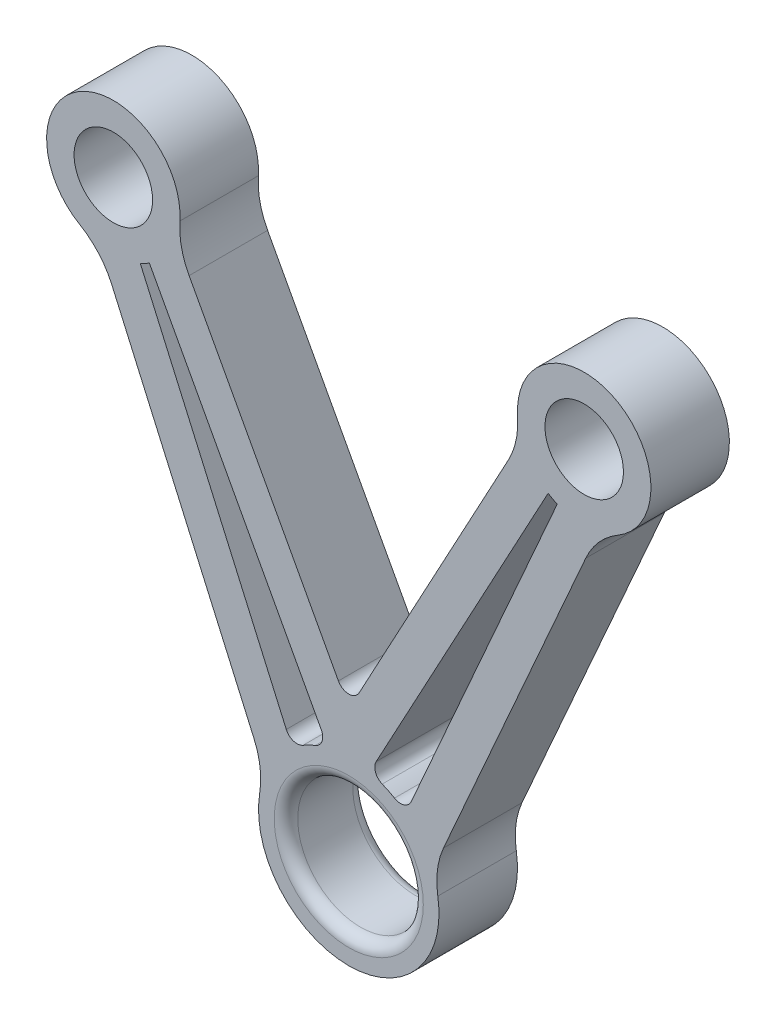
ISO-10303-21;
HEADER;
FILE_DESCRIPTION(('STEP AP214'),'2;1');
FILE_NAME('part.step','',(''),(''),'','','');
FILE_SCHEMA(('AUTOMOTIVE_DESIGN { 1 0 10303 214 1 1 1 1 }'));
ENDSEC;
DATA;
#1=APPLICATION_CONTEXT('core data for automotive mechanical design processes');
#2=APPLICATION_PROTOCOL_DEFINITION('international standard','automotive_design',2000,#1);
#3=PRODUCT_CONTEXT('',#1,'mechanical');
#4=PRODUCT('Part','Part','',(#3));
#5=PRODUCT_RELATED_PRODUCT_CATEGORY('part','',(#4));
#6=PRODUCT_DEFINITION_FORMATION('','',#4);
#7=PRODUCT_DEFINITION_CONTEXT('part definition',#1,'design');
#8=PRODUCT_DEFINITION('design','',#6,#7);
#9=PRODUCT_DEFINITION_SHAPE('','',#8);
#10=(LENGTH_UNIT() NAMED_UNIT(*) SI_UNIT(.MILLI.,.METRE.));
#11=(NAMED_UNIT(*) PLANE_ANGLE_UNIT() SI_UNIT($,.RADIAN.));
#12=(NAMED_UNIT(*) SI_UNIT($,.STERADIAN.) SOLID_ANGLE_UNIT());
#13=UNCERTAINTY_MEASURE_WITH_UNIT(LENGTH_MEASURE(1.E-05),#10,'distance_accuracy_value','');
#14=(GEOMETRIC_REPRESENTATION_CONTEXT(3) GLOBAL_UNCERTAINTY_ASSIGNED_CONTEXT((#13)) GLOBAL_UNIT_ASSIGNED_CONTEXT((#10,
#11,#12)) REPRESENTATION_CONTEXT('',''));
#15=CARTESIAN_POINT('',(0.,0.,0.));
#16=DIRECTION('',(0.,0.,1.));
#17=DIRECTION('',(1.,0.,0.));
#18=AXIS2_PLACEMENT_3D('',#15,#16,#17);
#19=CARTESIAN_POINT('',(-18.260997509463,-9.86478662682293,5.));
#20=DIRECTION('',(0.879827873615152,0.475292449771549,0.));
#21=DIRECTION('',(-0.475292449771549,0.879827873615152,0.));
#22=AXIS2_PLACEMENT_3D('',#19,#20,#21);
#23=PLANE('',#22);
#24=DIRECTION('',(0.475292449771549,-0.879827873615152,0.));
#25=VECTOR('',#24,1.);
#26=CARTESIAN_POINT('',(-18.260997509463,-9.86478662682293,5.));
#27=LINE('',#26,#25);
#28=CARTESIAN_POINT('',(-20.3413015894991,-6.01387438091866,5.));
#29=VERTEX_POINT('',#28);
#30=CARTESIAN_POINT('',(-1.31974181042273,-41.2252447725845,5.));
#31=VERTEX_POINT('',#30);
#32=EDGE_CURVE('E295',#29,#31,#27,.T.);
#33=ORIENTED_EDGE('',*,*,#32,.T.);
#34=DIRECTION('',(0.,0.,-1.));
#35=VECTOR('',#34,1.);
#36=CARTESIAN_POINT('',(-1.31974181042273,-41.2252447725845,5.));
#37=LINE('',#36,#35);
#38=CARTESIAN_POINT('',(-1.31974181042273,-41.2252447725845,-5.));
#39=VERTEX_POINT('',#38);
#40=EDGE_CURVE('E483',#31,#39,#37,.T.);
#41=ORIENTED_EDGE('',*,*,#40,.T.);
#42=DIRECTION('',(0.475292449771549,-0.879827873615152,0.));
#43=VECTOR('',#42,1.);
#44=CARTESIAN_POINT('',(-18.260997509463,-9.86478662682293,-5.));
#45=LINE('',#44,#43);
#46=CARTESIAN_POINT('',(-20.3413015894991,-6.01387438091866,-5.));
#47=VERTEX_POINT('',#46);
#48=EDGE_CURVE('E257',#47,#39,#45,.T.);
#49=ORIENTED_EDGE('',*,*,#48,.F.);
#50=DIRECTION('',(0.,0.,-1.));
#51=VECTOR('',#50,1.);
#52=CARTESIAN_POINT('',(-20.3413015894991,-6.01387438091866,5.));
#53=LINE('',#52,#51);
#54=EDGE_CURVE('E388',#47,#29,#53,.F.);
#55=ORIENTED_EDGE('',*,*,#54,.T.);
#56=EDGE_LOOP('',(#33,#41,#49,#55));
#57=FACE_BOUND('',#56,.T.);
#58=ADVANCED_FACE('F41',(#57),#23,.T.);
#59=CARTESIAN_POINT('',(-30.,0.,5.));
#60=DIRECTION('',(0.,0.,-1.));
#61=DIRECTION('',(-1.,0.,0.));
#62=AXIS2_PLACEMENT_3D('',#59,#60,#61);
#63=CYLINDRICAL_SURFACE('',#62,8.5);
#64=CARTESIAN_POINT('',(-30.,0.,5.));
#65=DIRECTION('',(0.,0.,1.));
#66=DIRECTION('',(1.,0.,0.));
#67=AXIS2_PLACEMENT_3D('',#64,#65,#66);
#68=CIRCLE('',#67,8.5);
#69=CARTESIAN_POINT('',(-21.5197672569435,-0.579355351741999,5.));
#70=VERTEX_POINT('',#69);
#71=CARTESIAN_POINT('',(-34.2943875859806,-7.33540968599409,5.));
#72=VERTEX_POINT('',#71);
#73=EDGE_CURVE('E298',#70,#72,#68,.T.);
#74=ORIENTED_EDGE('',*,*,#73,.F.);
#75=DIRECTION('',(0.,0.,-1.));
#76=VECTOR('',#75,1.);
#77=CARTESIAN_POINT('',(-21.5197672569435,-0.579355351741999,5.));
#78=LINE('',#77,#76);
#79=CARTESIAN_POINT('',(-21.5197672569435,-0.579355351741999,-5.));
#80=VERTEX_POINT('',#79);
#81=EDGE_CURVE('E384',#70,#80,#78,.T.);
#82=ORIENTED_EDGE('',*,*,#81,.T.);
#83=CARTESIAN_POINT('',(-30.,0.,-5.));
#84=DIRECTION('',(0.,0.,1.));
#85=DIRECTION('',(1.,0.,0.));
#86=AXIS2_PLACEMENT_3D('',#83,#84,#85);
#87=CIRCLE('',#86,8.5);
#88=CARTESIAN_POINT('',(-34.2943875859806,-7.33540968599409,-5.));
#89=VERTEX_POINT('',#88);
#90=EDGE_CURVE('E334',#80,#89,#87,.T.);
#91=ORIENTED_EDGE('',*,*,#90,.T.);
#92=DIRECTION('',(0.,0.,-1.));
#93=VECTOR('',#92,1.);
#94=CARTESIAN_POINT('',(-34.2943875859806,-7.33540968599409,5.));
#95=LINE('',#94,#93);
#96=EDGE_CURVE('E381',#89,#72,#95,.F.);
#97=ORIENTED_EDGE('',*,*,#96,.T.);
#98=EDGE_LOOP('',(#74,#82,#91,#97));
#99=FACE_BOUND('',#98,.T.);
#100=ADVANCED_FACE('F532',(#99),#63,.T.);
#101=CARTESIAN_POINT('',(-29.6770389457821,-13.1071615622025,5.));
#102=DIRECTION('',(0.914754376224556,0.404010434491516,0.));
#103=DIRECTION('',(-0.404010434491516,0.914754376224556,0.));
#104=AXIS2_PLACEMENT_3D('',#101,#102,#103);
#105=PLANE('',#104);
#106=DIRECTION('',(0.404010434491516,-0.914754376224556,0.));
#107=VECTOR('',#106,1.);
#108=CARTESIAN_POINT('',(-29.6770389457821,-13.1071615622025,5.));
#109=LINE('',#108,#107);
#110=CARTESIAN_POINT('',(-30.199064513124,-11.9251990893073,5.));
#111=VERTEX_POINT('',#110);
#112=CARTESIAN_POINT('',(-12.0683800088846,-52.9764234594739,5.));
#113=VERTEX_POINT('',#112);
#114=EDGE_CURVE('E303',#111,#113,#109,.T.);
#115=ORIENTED_EDGE('',*,*,#114,.F.);
#116=DIRECTION('',(0.,0.,1.));
#117=VECTOR('',#116,1.);
#118=CARTESIAN_POINT('',(-30.199064513124,-11.9251990893073,-5.));
#119=LINE('',#118,#117);
#120=CARTESIAN_POINT('',(-30.199064513124,-11.9251990893073,-5.));
#121=VERTEX_POINT('',#120);
#122=EDGE_CURVE('E394',#111,#121,#119,.F.);
#123=ORIENTED_EDGE('',*,*,#122,.T.);
#124=DIRECTION('',(0.404010434491516,-0.914754376224556,0.));
#125=VECTOR('',#124,1.);
#126=CARTESIAN_POINT('',(-29.6770389457821,-13.1071615622025,-5.));
#127=LINE('',#126,#125);
#128=CARTESIAN_POINT('',(-12.0683800088846,-52.9764234594739,-5.));
#129=VERTEX_POINT('',#128);
#130=EDGE_CURVE('E338',#121,#129,#127,.T.);
#131=ORIENTED_EDGE('',*,*,#130,.T.);
#132=DIRECTION('',(0.,0.,1.));
#133=VECTOR('',#132,1.);
#134=CARTESIAN_POINT('',(-12.0683800088846,-52.9764234594739,5.));
#135=LINE('',#134,#133);
#136=EDGE_CURVE('E391',#129,#113,#135,.T.);
#137=ORIENTED_EDGE('',*,*,#136,.T.);
#138=EDGE_LOOP('',(#115,#123,#131,#137));
#139=FACE_BOUND('',#138,.T.);
#140=ADVANCED_FACE('F541',(#139),#105,.F.);
#141=CARTESIAN_POINT('',(0.,-60.5,5.));
#142=DIRECTION('',(0.,0.,-1.));
#143=DIRECTION('',(-1.,0.,0.));
#144=AXIS2_PLACEMENT_3D('',#141,#142,#143);
#145=CYLINDRICAL_SURFACE('',#144,11.5);
#146=CARTESIAN_POINT('',(0.,-60.5,5.));
#147=DIRECTION('',(0.,0.,1.));
#148=DIRECTION('',(1.,0.,0.));
#149=AXIS2_PLACEMENT_3D('',#146,#147,#148);
#150=CIRCLE('',#149,11.5);
#151=CARTESIAN_POINT('',(-11.3480522496743,-58.6367474302546,5.));
#152=VERTEX_POINT('',#151);
#153=CARTESIAN_POINT('',(11.3480522496743,-58.6367474302546,5.));
#154=VERTEX_POINT('',#153);
#155=EDGE_CURVE('E307',#152,#154,#150,.T.);
#156=ORIENTED_EDGE('',*,*,#155,.F.);
#157=DIRECTION('',(0.,0.,-1.));
#158=VECTOR('',#157,1.);
#159=CARTESIAN_POINT('',(-11.3480522496743,-58.6367474302546,5.));
#160=LINE('',#159,#158);
#161=CARTESIAN_POINT('',(-11.3480522496743,-58.6367474302546,-5.));
#162=VERTEX_POINT('',#161);
#163=EDGE_CURVE('E401',#152,#162,#160,.T.);
#164=ORIENTED_EDGE('',*,*,#163,.T.);
#165=CARTESIAN_POINT('',(0.,-60.5,-5.));
#166=DIRECTION('',(0.,0.,1.));
#167=DIRECTION('',(1.,0.,0.));
#168=AXIS2_PLACEMENT_3D('',#165,#166,#167);
#169=CIRCLE('',#168,11.5);
#170=CARTESIAN_POINT('',(11.3480522496743,-58.6367474302546,-5.));
#171=VERTEX_POINT('',#170);
#172=EDGE_CURVE('E342',#162,#171,#169,.T.);
#173=ORIENTED_EDGE('',*,*,#172,.T.);
#174=DIRECTION('',(0.,0.,-1.));
#175=VECTOR('',#174,1.);
#176=CARTESIAN_POINT('',(11.3480522496743,-58.6367474302546,5.));
#177=LINE('',#176,#175);
#178=EDGE_CURVE('E398',#171,#154,#177,.F.);
#179=ORIENTED_EDGE('',*,*,#178,.T.);
#180=EDGE_LOOP('',(#156,#164,#173,#179));
#181=FACE_BOUND('',#180,.T.);
#182=ADVANCED_FACE('F550',(#181),#145,.T.);
#183=CARTESIAN_POINT('',(29.6770389457821,-13.1071615622025,5.));
#184=DIRECTION('',(0.914754376224556,-0.404010434491516,0.));
#185=DIRECTION('',(0.404010434491516,0.914754376224556,0.));
#186=AXIS2_PLACEMENT_3D('',#183,#184,#185);
#187=PLANE('',#186);
#188=DIRECTION('',(-0.404010434491516,-0.914754376224556,0.));
#189=VECTOR('',#188,1.);
#190=CARTESIAN_POINT('',(29.6770389457821,-13.1071615622025,-5.));
#191=LINE('',#190,#189);
#192=CARTESIAN_POINT('',(30.199064513124,-11.9251990893073,-5.));
#193=VERTEX_POINT('',#192);
#194=CARTESIAN_POINT('',(12.0683800088846,-52.9764234594739,-5.));
#195=VERTEX_POINT('',#194);
#196=EDGE_CURVE('E346',#193,#195,#191,.T.);
#197=ORIENTED_EDGE('',*,*,#196,.F.);
#198=DIRECTION('',(0.,0.,-1.));
#199=VECTOR('',#198,1.);
#200=CARTESIAN_POINT('',(30.199064513124,-11.9251990893073,5.));
#201=LINE('',#200,#199);
#202=CARTESIAN_POINT('',(30.199064513124,-11.9251990893073,5.));
#203=VERTEX_POINT('',#202);
#204=EDGE_CURVE('E378',#193,#203,#201,.F.);
#205=ORIENTED_EDGE('',*,*,#204,.T.);
#206=DIRECTION('',(-0.404010434491516,-0.914754376224556,0.));
#207=VECTOR('',#206,1.);
#208=CARTESIAN_POINT('',(29.6770389457821,-13.1071615622025,5.));
#209=LINE('',#208,#207);
#210=CARTESIAN_POINT('',(12.0683800088846,-52.9764234594739,5.));
#211=VERTEX_POINT('',#210);
#212=EDGE_CURVE('E311',#203,#211,#209,.T.);
#213=ORIENTED_EDGE('',*,*,#212,.T.);
#214=DIRECTION('',(0.,0.,-1.));
#215=VECTOR('',#214,1.);
#216=CARTESIAN_POINT('',(12.0683800088846,-52.9764234594739,5.));
#217=LINE('',#216,#215);
#218=EDGE_CURVE('E374',#211,#195,#217,.T.);
#219=ORIENTED_EDGE('',*,*,#218,.T.);
#220=EDGE_LOOP('',(#197,#205,#213,#219));
#221=FACE_BOUND('',#220,.T.);
#222=ADVANCED_FACE('F558',(#221),#187,.T.);
#223=CARTESIAN_POINT('',(30.,0.,5.));
#224=DIRECTION('',(0.,0.,-1.));
#225=DIRECTION('',(-1.,0.,0.));
#226=AXIS2_PLACEMENT_3D('',#223,#224,#225);
#227=CYLINDRICAL_SURFACE('',#226,8.5);
#228=CARTESIAN_POINT('',(30.,0.,-5.));
#229=DIRECTION('',(0.,0.,1.));
#230=DIRECTION('',(1.,0.,0.));
#231=AXIS2_PLACEMENT_3D('',#228,#229,#230);
#232=CIRCLE('',#231,8.5);
#233=CARTESIAN_POINT('',(34.2943875859806,-7.33540968599409,-5.));
#234=VERTEX_POINT('',#233);
#235=CARTESIAN_POINT('',(21.5197672569435,-0.579355351741998,-5.));
#236=VERTEX_POINT('',#235);
#237=EDGE_CURVE('E350',#234,#236,#232,.T.);
#238=ORIENTED_EDGE('',*,*,#237,.T.);
#239=DIRECTION('',(0.,0.,-1.));
#240=VECTOR('',#239,1.);
#241=CARTESIAN_POINT('',(21.5197672569435,-0.579355351741998,5.));
#242=LINE('',#241,#240);
#243=CARTESIAN_POINT('',(21.5197672569435,-0.579355351741998,5.));
#244=VERTEX_POINT('',#243);
#245=EDGE_CURVE('E371',#236,#244,#242,.F.);
#246=ORIENTED_EDGE('',*,*,#245,.T.);
#247=CARTESIAN_POINT('',(30.,0.,5.));
#248=DIRECTION('',(0.,0.,1.));
#249=DIRECTION('',(1.,0.,0.));
#250=AXIS2_PLACEMENT_3D('',#247,#248,#249);
#251=CIRCLE('',#250,8.5);
#252=CARTESIAN_POINT('',(34.2943875859806,-7.33540968599409,5.));
#253=VERTEX_POINT('',#252);
#254=EDGE_CURVE('E315',#253,#244,#251,.T.);
#255=ORIENTED_EDGE('',*,*,#254,.F.);
#256=DIRECTION('',(0.,0.,-1.));
#257=VECTOR('',#256,1.);
#258=CARTESIAN_POINT('',(34.2943875859806,-7.33540968599409,5.));
#259=LINE('',#258,#257);
#260=EDGE_CURVE('E367',#253,#234,#259,.T.);
#261=ORIENTED_EDGE('',*,*,#260,.T.);
#262=EDGE_LOOP('',(#238,#246,#255,#261));
#263=FACE_BOUND('',#262,.T.);
#264=ADVANCED_FACE('F568',(#263),#227,.T.);
#265=CARTESIAN_POINT('',(-30.,0.,5.));
#266=DIRECTION('',(0.,0.,-1.));
#267=DIRECTION('',(-1.,0.,0.));
#268=AXIS2_PLACEMENT_3D('',#265,#266,#267);
#269=CYLINDRICAL_SURFACE('',#268,5.);
#270=CARTESIAN_POINT('',(-30.,0.,5.));
#271=DIRECTION('',(0.,0.,1.));
#272=DIRECTION('',(1.,0.,0.));
#273=AXIS2_PLACEMENT_3D('',#270,#271,#272);
#274=CIRCLE('',#273,5.);
#275=CARTESIAN_POINT('',(-25.,0.,5.));
#276=VERTEX_POINT('',#275);
#277=EDGE_CURVE('E326',#276,#276,#274,.T.);
#278=ORIENTED_EDGE('',*,*,#277,.T.);
#279=EDGE_LOOP('',(#278));
#280=FACE_BOUND('',#279,.T.);
#281=CARTESIAN_POINT('',(-30.,0.,-5.));
#282=DIRECTION('',(0.,0.,1.));
#283=DIRECTION('',(1.,0.,0.));
#284=AXIS2_PLACEMENT_3D('',#281,#282,#283);
#285=CIRCLE('',#284,5.);
#286=CARTESIAN_POINT('',(-25.,0.,-5.));
#287=VERTEX_POINT('',#286);
#288=EDGE_CURVE('E299',#287,#287,#285,.T.);
#289=ORIENTED_EDGE('',*,*,#288,.F.);
#290=EDGE_LOOP('',(#289));
#291=FACE_BOUND('',#290,.T.);
#292=ADVANCED_FACE('F597',(#280,#291),#269,.F.);
#293=CARTESIAN_POINT('',(30.,0.,5.));
#294=DIRECTION('',(0.,0.,-1.));
#295=DIRECTION('',(-1.,0.,0.));
#296=AXIS2_PLACEMENT_3D('',#293,#294,#295);
#297=CYLINDRICAL_SURFACE('',#296,5.);
#298=CARTESIAN_POINT('',(30.,0.,5.));
#299=DIRECTION('',(0.,0.,1.));
#300=DIRECTION('',(1.,0.,0.));
#301=AXIS2_PLACEMENT_3D('',#298,#299,#300);
#302=CIRCLE('',#301,5.);
#303=CARTESIAN_POINT('',(35.,0.,5.));
#304=VERTEX_POINT('',#303);
#305=EDGE_CURVE('E322',#304,#304,#302,.T.);
#306=ORIENTED_EDGE('',*,*,#305,.T.);
#307=EDGE_LOOP('',(#306));
#308=FACE_BOUND('',#307,.T.);
#309=CARTESIAN_POINT('',(30.,0.,-5.));
#310=DIRECTION('',(0.,0.,1.));
#311=DIRECTION('',(1.,0.,0.));
#312=AXIS2_PLACEMENT_3D('',#309,#310,#311);
#313=CIRCLE('',#312,5.);
#314=CARTESIAN_POINT('',(35.,0.,-5.));
#315=VERTEX_POINT('',#314);
#316=EDGE_CURVE('E357',#315,#315,#313,.T.);
#317=ORIENTED_EDGE('',*,*,#316,.F.);
#318=EDGE_LOOP('',(#317));
#319=FACE_BOUND('',#318,.T.);
#320=ADVANCED_FACE('F601',(#308,#319),#297,.F.);
#321=CARTESIAN_POINT('',(18.260997509463,-9.86478662682293,5.));
#322=DIRECTION('',(0.879827873615152,-0.475292449771549,0.));
#323=DIRECTION('',(0.475292449771549,0.879827873615152,0.));
#324=AXIS2_PLACEMENT_3D('',#321,#322,#323);
#325=PLANE('',#324);
#326=DIRECTION('',(-0.475292449771549,-0.879827873615152,0.));
#327=VECTOR('',#326,1.);
#328=CARTESIAN_POINT('',(18.260997509463,-9.86478662682293,-5.));
#329=LINE('',#328,#327);
#330=CARTESIAN_POINT('',(20.3413015894991,-6.01387438091866,-5.));
#331=VERTEX_POINT('',#330);
#332=CARTESIAN_POINT('',(1.31974181042272,-41.2252447725845,-5.));
#333=VERTEX_POINT('',#332);
#334=EDGE_CURVE('E354',#331,#333,#329,.T.);
#335=ORIENTED_EDGE('',*,*,#334,.T.);
#336=DIRECTION('',(0.,0.,-1.));
#337=VECTOR('',#336,1.);
#338=CARTESIAN_POINT('',(1.31974181042273,-41.2252447725845,5.));
#339=LINE('',#338,#337);
#340=CARTESIAN_POINT('',(1.31974181042272,-41.2252447725845,5.));
#341=VERTEX_POINT('',#340);
#342=EDGE_CURVE('E57',#333,#341,#339,.F.);
#343=ORIENTED_EDGE('',*,*,#342,.T.);
#344=DIRECTION('',(-0.475292449771549,-0.879827873615152,0.));
#345=VECTOR('',#344,1.);
#346=CARTESIAN_POINT('',(18.260997509463,-9.86478662682293,5.));
#347=LINE('',#346,#345);
#348=CARTESIAN_POINT('',(20.3413015894991,-6.01387438091866,5.));
#349=VERTEX_POINT('',#348);
#350=EDGE_CURVE('E319',#349,#341,#347,.T.);
#351=ORIENTED_EDGE('',*,*,#350,.F.);
#352=DIRECTION('',(0.,0.,1.));
#353=VECTOR('',#352,1.);
#354=CARTESIAN_POINT('',(20.3413015894991,-6.01387438091866,-5.));
#355=LINE('',#354,#353);
#356=EDGE_CURVE('E330',#349,#331,#355,.F.);
#357=ORIENTED_EDGE('',*,*,#356,.T.);
#358=EDGE_LOOP('',(#335,#343,#351,#357));
#359=FACE_BOUND('',#358,.T.);
#360=ADVANCED_FACE('F521',(#359),#325,.F.);
#361=CARTESIAN_POINT('',(0.,-60.5,5.));
#362=DIRECTION('',(0.,0.,-1.));
#363=DIRECTION('',(-1.,0.,0.));
#364=AXIS2_PLACEMENT_3D('',#361,#362,#363);
#365=CYLINDRICAL_SURFACE('',#364,8.);
#366=CARTESIAN_POINT('',(0.,-60.5,-3.5));
#367=DIRECTION('',(0.,0.,1.));
#368=DIRECTION('',(1.,0.,0.));
#369=AXIS2_PLACEMENT_3D('',#366,#367,#368);
#370=CIRCLE('',#369,8.);
#371=CARTESIAN_POINT('',(8.,-60.5,-3.5));
#372=VERTEX_POINT('',#371);
#373=EDGE_CURVE('E449',#372,#372,#370,.F.);
#374=ORIENTED_EDGE('',*,*,#373,.T.);
#375=EDGE_LOOP('',(#374));
#376=FACE_BOUND('',#375,.T.);
#377=CARTESIAN_POINT('',(0.,-60.5,3.5));
#378=DIRECTION('',(0.,0.,1.));
#379=DIRECTION('',(1.,0.,0.));
#380=AXIS2_PLACEMENT_3D('',#377,#378,#379);
#381=CIRCLE('',#380,8.);
#382=CARTESIAN_POINT('',(8.,-60.5,3.5));
#383=VERTEX_POINT('',#382);
#384=EDGE_CURVE('E445',#383,#383,#381,.T.);
#385=ORIENTED_EDGE('',*,*,#384,.T.);
#386=EDGE_LOOP('',(#385));
#387=FACE_BOUND('',#386,.T.);
#388=ADVANCED_FACE('F600',(#376,#387),#365,.F.);
#389=CARTESIAN_POINT('',(0.,0.,5.));
#390=DIRECTION('',(0.,0.,1.));
#391=DIRECTION('',(1.,0.,0.));
#392=AXIS2_PLACEMENT_3D('',#389,#390,#391);
#393=PLANE('',#392);
#394=CARTESIAN_POINT('',(0.,-60.5,5.));
#395=DIRECTION('',(0.,0.,1.));
#396=DIRECTION('',(1.,0.,0.));
#397=AXIS2_PLACEMENT_3D('',#394,#395,#396);
#398=CIRCLE('',#397,9.5);
#399=CARTESIAN_POINT('',(9.5,-60.5,5.));
#400=VERTEX_POINT('',#399);
#401=EDGE_CURVE('E453',#400,#400,#398,.F.);
#402=ORIENTED_EDGE('',*,*,#401,.T.);
#403=EDGE_LOOP('',(#402));
#404=FACE_BOUND('',#403,.T.);
#405=CARTESIAN_POINT('',(0.,-60.5,5.));
#406=DIRECTION('',(0.,0.,-1.));
#407=DIRECTION('',(1.,0.,0.));
#408=AXIS2_PLACEMENT_3D('',#405,#406,#407);
#409=CIRCLE('',#408,11.5);
#410=CARTESIAN_POINT('',(4.26189216184041,-49.8188823056366,5.));
#411=VERTEX_POINT('',#410);
#412=CARTESIAN_POINT('',(5.82889674170213,-50.5866775108153,5.));
#413=VERTEX_POINT('',#412);
#414=EDGE_CURVE('E228',#411,#413,#409,.T.);
#415=ORIENTED_EDGE('',*,*,#414,.F.);
#416=CARTESIAN_POINT('',(4.81779113947177,-48.4256930411544,5.));
#417=DIRECTION('',(0.,0.,1.));
#418=DIRECTION('',(1.,0.,0.));
#419=AXIS2_PLACEMENT_3D('',#416,#417,#418);
#420=CIRCLE('',#419,1.5);
#421=CARTESIAN_POINT('',(3.49804932904904,-47.7127543664971,5.));
#422=VERTEX_POINT('',#421);
#423=EDGE_CURVE('E495',#411,#422,#420,.F.);
#424=ORIENTED_EDGE('',*,*,#423,.T.);
#425=DIRECTION('',(-0.475292449771549,-0.879827873615152,0.));
#426=VECTOR('',#425,1.);
#427=CARTESIAN_POINT('',(25.4086936589943,-7.15331434252971,5.));
#428=LINE('',#427,#426);
#429=CARTESIAN_POINT('',(25.4086936589943,-7.15331434252971,5.));
#430=VERTEX_POINT('',#429);
#431=EDGE_CURVE('E240',#430,#422,#428,.T.);
#432=ORIENTED_EDGE('',*,*,#431,.F.);
#433=CARTESIAN_POINT('',(30.,0.,5.));
#434=DIRECTION('',(0.,0.,-1.));
#435=DIRECTION('',(1.,0.,0.));
#436=AXIS2_PLACEMENT_3D('',#433,#434,#435);
#437=CIRCLE('',#436,8.5);
#438=CARTESIAN_POINT('',(26.5659113068221,-7.77541219790873,5.));
#439=VERTEX_POINT('',#438);
#440=EDGE_CURVE('E227',#439,#430,#437,.T.);
#441=ORIENTED_EDGE('',*,*,#440,.F.);
#442=DIRECTION('',(0.404010434491515,0.914754376224556,0.));
#443=VECTOR('',#442,1.);
#444=CARTESIAN_POINT('',(26.5659113068221,-7.77541219790873,5.));
#445=LINE('',#444,#443);
#446=CARTESIAN_POINT('',(7.96131918539142,-49.8996510987459,5.));
#447=VERTEX_POINT('',#446);
#448=EDGE_CURVE('E216',#447,#439,#445,.T.);
#449=ORIENTED_EDGE('',*,*,#448,.F.);
#450=CARTESIAN_POINT('',(6.58918762105459,-49.2936354470087,5.));
#451=DIRECTION('',(0.,0.,1.));
#452=DIRECTION('',(1.,0.,0.));
#453=AXIS2_PLACEMENT_3D('',#450,#451,#452);
#454=CIRCLE('',#453,1.5);
#455=EDGE_CURVE('E489',#447,#413,#454,.F.);
#456=ORIENTED_EDGE('',*,*,#455,.T.);
#457=EDGE_LOOP('',(#415,#424,#432,#441,#449,#456));
#458=FACE_BOUND('',#457,.T.);
#459=CARTESIAN_POINT('',(-30.,0.,5.));
#460=DIRECTION('',(0.,0.,-1.));
#461=DIRECTION('',(1.,0.,0.));
#462=AXIS2_PLACEMENT_3D('',#459,#460,#461);
#463=CIRCLE('',#462,8.5);
#464=CARTESIAN_POINT('',(-25.4086936589943,-7.15331434252971,5.));
#465=VERTEX_POINT('',#464);
#466=CARTESIAN_POINT('',(-26.5659113068221,-7.77541219790873,5.));
#467=VERTEX_POINT('',#466);
#468=EDGE_CURVE('E272',#465,#467,#463,.T.);
#469=ORIENTED_EDGE('',*,*,#468,.F.);
#470=DIRECTION('',(-0.475292449771549,0.879827873615152,0.));
#471=VECTOR('',#470,1.);
#472=CARTESIAN_POINT('',(-25.4086936589943,-7.15331434252971,5.));
#473=LINE('',#472,#471);
#474=CARTESIAN_POINT('',(-3.49804932904904,-47.7127543664971,5.));
#475=VERTEX_POINT('',#474);
#476=EDGE_CURVE('E283',#475,#465,#473,.T.);
#477=ORIENTED_EDGE('',*,*,#476,.F.);
#478=CARTESIAN_POINT('',(-4.81779113947178,-48.4256930411544,5.));
#479=DIRECTION('',(0.,0.,1.));
#480=DIRECTION('',(1.,0.,0.));
#481=AXIS2_PLACEMENT_3D('',#478,#479,#480);
#482=CIRCLE('',#481,1.5);
#483=CARTESIAN_POINT('',(-4.26189216184042,-49.8188823056366,5.));
#484=VERTEX_POINT('',#483);
#485=EDGE_CURVE('E501',#475,#484,#482,.F.);
#486=ORIENTED_EDGE('',*,*,#485,.T.);
#487=CARTESIAN_POINT('',(0.,-60.5,5.));
#488=DIRECTION('',(0.,0.,-1.));
#489=DIRECTION('',(1.,0.,0.));
#490=AXIS2_PLACEMENT_3D('',#487,#488,#489);
#491=CIRCLE('',#490,11.5);
#492=CARTESIAN_POINT('',(-5.82889674170214,-50.5866775108153,5.));
#493=VERTEX_POINT('',#492);
#494=EDGE_CURVE('E279',#493,#484,#491,.T.);
#495=ORIENTED_EDGE('',*,*,#494,.F.);
#496=CARTESIAN_POINT('',(-6.58918762105459,-49.2936354470087,5.));
#497=DIRECTION('',(0.,0.,1.));
#498=DIRECTION('',(1.,0.,0.));
#499=AXIS2_PLACEMENT_3D('',#496,#497,#498);
#500=CIRCLE('',#499,1.5);
#501=CARTESIAN_POINT('',(-7.96131918539142,-49.8996510987459,5.));
#502=VERTEX_POINT('',#501);
#503=EDGE_CURVE('E507',#493,#502,#500,.F.);
#504=ORIENTED_EDGE('',*,*,#503,.T.);
#505=DIRECTION('',(0.404010434491515,-0.914754376224556,0.));
#506=VECTOR('',#505,1.);
#507=CARTESIAN_POINT('',(-26.5659113068221,-7.77541219790873,5.));
#508=LINE('',#507,#506);
#509=EDGE_CURVE('E275',#467,#502,#508,.T.);
#510=ORIENTED_EDGE('',*,*,#509,.F.);
#511=EDGE_LOOP('',(#469,#477,#486,#495,#504,#510));
#512=FACE_BOUND('',#511,.T.);
#513=ORIENTED_EDGE('',*,*,#32,.F.);
#514=CARTESIAN_POINT('',(-11.5430228533476,-1.26094988320317,5.));
#515=DIRECTION('',(0.,0.,1.));
#516=DIRECTION('',(1.,0.,0.));
#517=AXIS2_PLACEMENT_3D('',#514,#515,#516);
#518=CIRCLE('',#517,10.);
#519=EDGE_CURVE('E420',#29,#70,#518,.F.);
#520=ORIENTED_EDGE('',*,*,#519,.T.);
#521=ORIENTED_EDGE('',*,*,#73,.T.);
#522=CARTESIAN_POINT('',(-39.3466082753695,-15.9653034342224,5.));
#523=DIRECTION('',(0.,0.,1.));
#524=DIRECTION('',(1.,0.,0.));
#525=AXIS2_PLACEMENT_3D('',#522,#523,#524);
#526=CIRCLE('',#525,10.);
#527=EDGE_CURVE('E426',#72,#111,#526,.F.);
#528=ORIENTED_EDGE('',*,*,#527,.T.);
#529=ORIENTED_EDGE('',*,*,#114,.T.);
#530=CARTESIAN_POINT('',(-21.2159237711301,-57.016527804389,5.));
#531=DIRECTION('',(0.,0.,1.));
#532=DIRECTION('',(1.,0.,0.));
#533=AXIS2_PLACEMENT_3D('',#530,#531,#532);
#534=CIRCLE('',#533,10.);
#535=EDGE_CURVE('E432',#113,#152,#534,.F.);
#536=ORIENTED_EDGE('',*,*,#535,.T.);
#537=ORIENTED_EDGE('',*,*,#155,.T.);
#538=CARTESIAN_POINT('',(21.2159237711301,-57.016527804389,5.));
#539=DIRECTION('',(0.,0.,1.));
#540=DIRECTION('',(1.,0.,0.));
#541=AXIS2_PLACEMENT_3D('',#538,#539,#540);
#542=CIRCLE('',#541,10.);
#543=EDGE_CURVE('E438',#154,#211,#542,.F.);
#544=ORIENTED_EDGE('',*,*,#543,.T.);
#545=ORIENTED_EDGE('',*,*,#212,.F.);
#546=CARTESIAN_POINT('',(39.3466082753695,-15.9653034342224,5.));
#547=DIRECTION('',(0.,0.,1.));
#548=DIRECTION('',(1.,0.,0.));
#549=AXIS2_PLACEMENT_3D('',#546,#547,#548);
#550=CIRCLE('',#549,10.);
#551=EDGE_CURVE('E414',#203,#253,#550,.F.);
#552=ORIENTED_EDGE('',*,*,#551,.T.);
#553=ORIENTED_EDGE('',*,*,#254,.T.);
#554=CARTESIAN_POINT('',(11.5430228533476,-1.26094988320317,5.));
#555=DIRECTION('',(0.,0.,1.));
#556=DIRECTION('',(1.,0.,0.));
#557=AXIS2_PLACEMENT_3D('',#554,#555,#556);
#558=CIRCLE('',#557,10.);
#559=EDGE_CURVE('E408',#244,#349,#558,.F.);
#560=ORIENTED_EDGE('',*,*,#559,.T.);
#561=ORIENTED_EDGE('',*,*,#350,.T.);
#562=CARTESIAN_POINT('',(0.,-40.5123060979272,5.));
#563=DIRECTION('',(0.,0.,1.));
#564=DIRECTION('',(1.,0.,0.));
#565=AXIS2_PLACEMENT_3D('',#562,#563,#564);
#566=CIRCLE('',#565,1.5);
#567=EDGE_CURVE('E11',#341,#31,#566,.F.);
#568=ORIENTED_EDGE('',*,*,#567,.T.);
#569=EDGE_LOOP('',(#513,#520,#521,#528,#529,#536,#537,#544,#545,#552,#553,#560,#561,#568));
#570=FACE_BOUND('',#569,.T.);
#571=ORIENTED_EDGE('',*,*,#305,.F.);
#572=EDGE_LOOP('',(#571));
#573=FACE_BOUND('',#572,.T.);
#574=ORIENTED_EDGE('',*,*,#277,.F.);
#575=EDGE_LOOP('',(#574));
#576=FACE_BOUND('',#575,.T.);
#577=ADVANCED_FACE('F243',(#404,#458,#512,#570,#573,#576),#393,.T.);
#578=CARTESIAN_POINT('',(0.,0.,-5.));
#579=DIRECTION('',(0.,0.,1.));
#580=DIRECTION('',(1.,0.,0.));
#581=AXIS2_PLACEMENT_3D('',#578,#579,#580);
#582=PLANE('',#581);
#583=CARTESIAN_POINT('',(0.,-60.5,-5.));
#584=DIRECTION('',(0.,0.,1.));
#585=DIRECTION('',(1.,0.,0.));
#586=AXIS2_PLACEMENT_3D('',#583,#584,#585);
#587=CIRCLE('',#586,9.5);
#588=CARTESIAN_POINT('',(9.5,-60.5,-5.));
#589=VERTEX_POINT('',#588);
#590=EDGE_CURVE('E441',#589,#589,#587,.T.);
#591=ORIENTED_EDGE('',*,*,#590,.T.);
#592=EDGE_LOOP('',(#591));
#593=FACE_BOUND('',#592,.T.);
#594=DIRECTION('',(0.475292449771549,0.879827873615152,0.));
#595=VECTOR('',#594,1.);
#596=CARTESIAN_POINT('',(25.4086936589943,-7.15331434252971,-5.));
#597=LINE('',#596,#595);
#598=CARTESIAN_POINT('',(3.49804932904904,-47.7127543664971,-5.));
#599=VERTEX_POINT('',#598);
#600=CARTESIAN_POINT('',(25.4086936589943,-7.15331434252971,-5.));
#601=VERTEX_POINT('',#600);
#602=EDGE_CURVE('E655',#599,#601,#597,.T.);
#603=ORIENTED_EDGE('',*,*,#602,.F.);
#604=CARTESIAN_POINT('',(4.81779113947177,-48.4256930411544,-5.));
#605=DIRECTION('',(0.,0.,1.));
#606=DIRECTION('',(1.,0.,0.));
#607=AXIS2_PLACEMENT_3D('',#604,#605,#606);
#608=CIRCLE('',#607,1.5);
#609=CARTESIAN_POINT('',(4.26189216184041,-49.8188823056366,-5.));
#610=VERTEX_POINT('',#609);
#611=EDGE_CURVE('E498',#599,#610,#608,.T.);
#612=ORIENTED_EDGE('',*,*,#611,.T.);
#613=CARTESIAN_POINT('',(0.,-60.5,-5.));
#614=DIRECTION('',(0.,0.,1.));
#615=DIRECTION('',(1.,0.,0.));
#616=AXIS2_PLACEMENT_3D('',#613,#614,#615);
#617=CIRCLE('',#616,11.5);
#618=CARTESIAN_POINT('',(5.82889674170213,-50.5866775108153,-5.));
#619=VERTEX_POINT('',#618);
#620=EDGE_CURVE('E258',#619,#610,#617,.T.);
#621=ORIENTED_EDGE('',*,*,#620,.F.);
#622=CARTESIAN_POINT('',(6.58918762105459,-49.2936354470087,-5.));
#623=DIRECTION('',(0.,0.,1.));
#624=DIRECTION('',(1.,0.,0.));
#625=AXIS2_PLACEMENT_3D('',#622,#623,#624);
#626=CIRCLE('',#625,1.5);
#627=CARTESIAN_POINT('',(7.96131918539142,-49.8996510987459,-5.));
#628=VERTEX_POINT('',#627);
#629=EDGE_CURVE('E492',#619,#628,#626,.T.);
#630=ORIENTED_EDGE('',*,*,#629,.T.);
#631=DIRECTION('',(-0.404010434491515,-0.914754376224556,0.));
#632=VECTOR('',#631,1.);
#633=CARTESIAN_POINT('',(26.5659113068221,-7.77541219790873,-5.));
#634=LINE('',#633,#632);
#635=CARTESIAN_POINT('',(26.5659113068221,-7.77541219790873,-5.));
#636=VERTEX_POINT('',#635);
#637=EDGE_CURVE('E254',#636,#628,#634,.T.);
#638=ORIENTED_EDGE('',*,*,#637,.F.);
#639=CARTESIAN_POINT('',(30.,0.,-5.));
#640=DIRECTION('',(0.,0.,1.));
#641=DIRECTION('',(1.,0.,0.));
#642=AXIS2_PLACEMENT_3D('',#639,#640,#641);
#643=CIRCLE('',#642,8.5);
#644=EDGE_CURVE('E236',#601,#636,#643,.T.);
#645=ORIENTED_EDGE('',*,*,#644,.F.);
#646=EDGE_LOOP('',(#603,#612,#621,#630,#638,#645));
#647=FACE_BOUND('',#646,.T.);
#648=DIRECTION('',(0.475292449771549,-0.879827873615152,0.));
#649=VECTOR('',#648,1.);
#650=CARTESIAN_POINT('',(-25.4086936589943,-7.15331434252971,-5.));
#651=LINE('',#650,#649);
#652=CARTESIAN_POINT('',(-25.4086936589943,-7.15331434252971,-5.));
#653=VERTEX_POINT('',#652);
#654=CARTESIAN_POINT('',(-3.49804932904905,-47.7127543664971,-5.));
#655=VERTEX_POINT('',#654);
#656=EDGE_CURVE('E263',#653,#655,#651,.T.);
#657=ORIENTED_EDGE('',*,*,#656,.F.);
#658=CARTESIAN_POINT('',(-30.,0.,-5.));
#659=DIRECTION('',(0.,0.,1.));
#660=DIRECTION('',(1.,0.,0.));
#661=AXIS2_PLACEMENT_3D('',#658,#659,#660);
#662=CIRCLE('',#661,8.5);
#663=CARTESIAN_POINT('',(-26.5659113068221,-7.77541219790873,-5.));
#664=VERTEX_POINT('',#663);
#665=EDGE_CURVE('E268',#664,#653,#662,.T.);
#666=ORIENTED_EDGE('',*,*,#665,.F.);
#667=DIRECTION('',(-0.404010434491515,0.914754376224556,0.));
#668=VECTOR('',#667,1.);
#669=CARTESIAN_POINT('',(-26.5659113068221,-7.77541219790873,-5.));
#670=LINE('',#669,#668);
#671=CARTESIAN_POINT('',(-7.96131918539142,-49.8996510987459,-5.));
#672=VERTEX_POINT('',#671);
#673=EDGE_CURVE('E271',#672,#664,#670,.T.);
#674=ORIENTED_EDGE('',*,*,#673,.F.);
#675=CARTESIAN_POINT('',(-6.58918762105459,-49.2936354470087,-5.));
#676=DIRECTION('',(0.,0.,1.));
#677=DIRECTION('',(1.,0.,0.));
#678=AXIS2_PLACEMENT_3D('',#675,#676,#677);
#679=CIRCLE('',#678,1.5);
#680=CARTESIAN_POINT('',(-5.82889674170214,-50.5866775108153,-5.));
#681=VERTEX_POINT('',#680);
#682=EDGE_CURVE('E510',#672,#681,#679,.T.);
#683=ORIENTED_EDGE('',*,*,#682,.T.);
#684=CARTESIAN_POINT('',(0.,-60.5,-5.));
#685=DIRECTION('',(0.,0.,1.));
#686=DIRECTION('',(1.,0.,0.));
#687=AXIS2_PLACEMENT_3D('',#684,#685,#686);
#688=CIRCLE('',#687,11.5);
#689=CARTESIAN_POINT('',(-4.26189216184042,-49.8188823056366,-5.));
#690=VERTEX_POINT('',#689);
#691=EDGE_CURVE('E259',#690,#681,#688,.T.);
#692=ORIENTED_EDGE('',*,*,#691,.F.);
#693=CARTESIAN_POINT('',(-4.81779113947178,-48.4256930411544,-5.));
#694=DIRECTION('',(0.,0.,1.));
#695=DIRECTION('',(1.,0.,0.));
#696=AXIS2_PLACEMENT_3D('',#693,#694,#695);
#697=CIRCLE('',#696,1.5);
#698=EDGE_CURVE('E504',#690,#655,#697,.T.);
#699=ORIENTED_EDGE('',*,*,#698,.T.);
#700=EDGE_LOOP('',(#657,#666,#674,#683,#692,#699));
#701=FACE_BOUND('',#700,.T.);
#702=ORIENTED_EDGE('',*,*,#90,.F.);
#703=CARTESIAN_POINT('',(-11.5430228533476,-1.26094988320317,-5.));
#704=DIRECTION('',(0.,0.,1.));
#705=DIRECTION('',(1.,0.,0.));
#706=AXIS2_PLACEMENT_3D('',#703,#704,#705);
#707=CIRCLE('',#706,10.);
#708=EDGE_CURVE('E417',#80,#47,#707,.T.);
#709=ORIENTED_EDGE('',*,*,#708,.T.);
#710=ORIENTED_EDGE('',*,*,#48,.T.);
#711=CARTESIAN_POINT('',(0.,-40.5123060979272,-5.));
#712=DIRECTION('',(0.,0.,1.));
#713=DIRECTION('',(1.,0.,0.));
#714=AXIS2_PLACEMENT_3D('',#711,#712,#713);
#715=CIRCLE('',#714,1.5);
#716=EDGE_CURVE('E50',#39,#333,#715,.T.);
#717=ORIENTED_EDGE('',*,*,#716,.T.);
#718=ORIENTED_EDGE('',*,*,#334,.F.);
#719=CARTESIAN_POINT('',(11.5430228533476,-1.26094988320317,-5.));
#720=DIRECTION('',(0.,0.,1.));
#721=DIRECTION('',(1.,0.,0.));
#722=AXIS2_PLACEMENT_3D('',#719,#720,#721);
#723=CIRCLE('',#722,10.);
#724=EDGE_CURVE('E405',#331,#236,#723,.T.);
#725=ORIENTED_EDGE('',*,*,#724,.T.);
#726=ORIENTED_EDGE('',*,*,#237,.F.);
#727=CARTESIAN_POINT('',(39.3466082753695,-15.9653034342224,-5.));
#728=DIRECTION('',(0.,0.,1.));
#729=DIRECTION('',(1.,0.,0.));
#730=AXIS2_PLACEMENT_3D('',#727,#728,#729);
#731=CIRCLE('',#730,10.);
#732=EDGE_CURVE('E411',#234,#193,#731,.T.);
#733=ORIENTED_EDGE('',*,*,#732,.T.);
#734=ORIENTED_EDGE('',*,*,#196,.T.);
#735=CARTESIAN_POINT('',(21.2159237711301,-57.016527804389,-5.));
#736=DIRECTION('',(0.,0.,1.));
#737=DIRECTION('',(1.,0.,0.));
#738=AXIS2_PLACEMENT_3D('',#735,#736,#737);
#739=CIRCLE('',#738,10.);
#740=EDGE_CURVE('E435',#195,#171,#739,.T.);
#741=ORIENTED_EDGE('',*,*,#740,.T.);
#742=ORIENTED_EDGE('',*,*,#172,.F.);
#743=CARTESIAN_POINT('',(-21.2159237711301,-57.016527804389,-5.));
#744=DIRECTION('',(0.,0.,1.));
#745=DIRECTION('',(1.,0.,0.));
#746=AXIS2_PLACEMENT_3D('',#743,#744,#745);
#747=CIRCLE('',#746,10.);
#748=EDGE_CURVE('E429',#162,#129,#747,.T.);
#749=ORIENTED_EDGE('',*,*,#748,.T.);
#750=ORIENTED_EDGE('',*,*,#130,.F.);
#751=CARTESIAN_POINT('',(-39.3466082753695,-15.9653034342224,-5.));
#752=DIRECTION('',(0.,0.,1.));
#753=DIRECTION('',(1.,0.,0.));
#754=AXIS2_PLACEMENT_3D('',#751,#752,#753);
#755=CIRCLE('',#754,10.);
#756=EDGE_CURVE('E423',#121,#89,#755,.T.);
#757=ORIENTED_EDGE('',*,*,#756,.T.);
#758=EDGE_LOOP('',(#702,#709,#710,#717,#718,#725,#726,#733,#734,#741,#742,#749,#750,#757));
#759=FACE_BOUND('',#758,.T.);
#760=ORIENTED_EDGE('',*,*,#316,.T.);
#761=EDGE_LOOP('',(#760));
#762=FACE_BOUND('',#761,.T.);
#763=ORIENTED_EDGE('',*,*,#288,.T.);
#764=EDGE_LOOP('',(#763));
#765=FACE_BOUND('',#764,.T.);
#766=ADVANCED_FACE('F516',(#593,#647,#701,#759,#762,#765),#582,.F.);
#767=CARTESIAN_POINT('',(11.5430228533476,-1.26094988320317,5.));
#768=DIRECTION('',(0.,0.,-1.));
#769=DIRECTION('',(-1.,0.,0.));
#770=AXIS2_PLACEMENT_3D('',#767,#768,#769);
#771=CYLINDRICAL_SURFACE('',#770,10.);
#772=ORIENTED_EDGE('',*,*,#559,.F.);
#773=ORIENTED_EDGE('',*,*,#245,.F.);
#774=ORIENTED_EDGE('',*,*,#724,.F.);
#775=ORIENTED_EDGE('',*,*,#356,.F.);
#776=EDGE_LOOP('',(#772,#773,#774,#775));
#777=FACE_BOUND('',#776,.T.);
#778=ADVANCED_FACE('F572',(#777),#771,.F.);
#779=CARTESIAN_POINT('',(39.3466082753695,-15.9653034342224,5.));
#780=DIRECTION('',(0.,0.,-1.));
#781=DIRECTION('',(-1.,0.,0.));
#782=AXIS2_PLACEMENT_3D('',#779,#780,#781);
#783=CYLINDRICAL_SURFACE('',#782,10.);
#784=ORIENTED_EDGE('',*,*,#551,.F.);
#785=ORIENTED_EDGE('',*,*,#204,.F.);
#786=ORIENTED_EDGE('',*,*,#732,.F.);
#787=ORIENTED_EDGE('',*,*,#260,.F.);
#788=EDGE_LOOP('',(#784,#785,#786,#787));
#789=FACE_BOUND('',#788,.T.);
#790=ADVANCED_FACE('F565',(#789),#783,.F.);
#791=CARTESIAN_POINT('',(-11.5430228533476,-1.26094988320317,5.));
#792=DIRECTION('',(0.,0.,-1.));
#793=DIRECTION('',(-1.,0.,0.));
#794=AXIS2_PLACEMENT_3D('',#791,#792,#793);
#795=CYLINDRICAL_SURFACE('',#794,10.);
#796=ORIENTED_EDGE('',*,*,#519,.F.);
#797=ORIENTED_EDGE('',*,*,#54,.F.);
#798=ORIENTED_EDGE('',*,*,#708,.F.);
#799=ORIENTED_EDGE('',*,*,#81,.F.);
#800=EDGE_LOOP('',(#796,#797,#798,#799));
#801=FACE_BOUND('',#800,.T.);
#802=ADVANCED_FACE('F530',(#801),#795,.F.);
#803=CARTESIAN_POINT('',(-39.3466082753695,-15.9653034342224,5.));
#804=DIRECTION('',(0.,0.,-1.));
#805=DIRECTION('',(-1.,0.,0.));
#806=AXIS2_PLACEMENT_3D('',#803,#804,#805);
#807=CYLINDRICAL_SURFACE('',#806,10.);
#808=ORIENTED_EDGE('',*,*,#527,.F.);
#809=ORIENTED_EDGE('',*,*,#96,.F.);
#810=ORIENTED_EDGE('',*,*,#756,.F.);
#811=ORIENTED_EDGE('',*,*,#122,.F.);
#812=EDGE_LOOP('',(#808,#809,#810,#811));
#813=FACE_BOUND('',#812,.T.);
#814=ADVANCED_FACE('F538',(#813),#807,.F.);
#815=CARTESIAN_POINT('',(-21.2159237711301,-57.016527804389,5.));
#816=DIRECTION('',(0.,0.,-1.));
#817=DIRECTION('',(-1.,0.,0.));
#818=AXIS2_PLACEMENT_3D('',#815,#816,#817);
#819=CYLINDRICAL_SURFACE('',#818,10.);
#820=ORIENTED_EDGE('',*,*,#535,.F.);
#821=ORIENTED_EDGE('',*,*,#136,.F.);
#822=ORIENTED_EDGE('',*,*,#748,.F.);
#823=ORIENTED_EDGE('',*,*,#163,.F.);
#824=EDGE_LOOP('',(#820,#821,#822,#823));
#825=FACE_BOUND('',#824,.T.);
#826=ADVANCED_FACE('F547',(#825),#819,.F.);
#827=CARTESIAN_POINT('',(21.2159237711301,-57.016527804389,5.));
#828=DIRECTION('',(0.,0.,-1.));
#829=DIRECTION('',(-1.,0.,0.));
#830=AXIS2_PLACEMENT_3D('',#827,#828,#829);
#831=CYLINDRICAL_SURFACE('',#830,10.);
#832=ORIENTED_EDGE('',*,*,#543,.F.);
#833=ORIENTED_EDGE('',*,*,#178,.F.);
#834=ORIENTED_EDGE('',*,*,#740,.F.);
#835=ORIENTED_EDGE('',*,*,#218,.F.);
#836=EDGE_LOOP('',(#832,#833,#834,#835));
#837=FACE_BOUND('',#836,.T.);
#838=ADVANCED_FACE('F556',(#837),#831,.F.);
#839=CARTESIAN_POINT('',(-30.,0.,-55.4404573867194));
#840=DIRECTION('',(0.,0.,1.));
#841=DIRECTION('',(1.,0.,0.));
#842=AXIS2_PLACEMENT_3D('',#839,#840,#841);
#843=CYLINDRICAL_SURFACE('',#842,8.5);
#844=ORIENTED_EDGE('',*,*,#665,.T.);
#845=DIRECTION('',(0.,0.,1.));
#846=VECTOR('',#845,1.);
#847=CARTESIAN_POINT('',(-25.4086936589943,-7.15331434252971,-55.4404573867194));
#848=LINE('',#847,#846);
#849=EDGE_CURVE('E264',#653,#465,#848,.T.);
#850=ORIENTED_EDGE('',*,*,#849,.T.);
#851=ORIENTED_EDGE('',*,*,#468,.T.);
#852=DIRECTION('',(0.,0.,1.));
#853=VECTOR('',#852,1.);
#854=CARTESIAN_POINT('',(-26.5659113068221,-7.77541219790873,-55.4404573867194));
#855=LINE('',#854,#853);
#856=EDGE_CURVE('E286',#664,#467,#855,.T.);
#857=ORIENTED_EDGE('',*,*,#856,.F.);
#858=EDGE_LOOP('',(#844,#850,#851,#857));
#859=FACE_BOUND('',#858,.T.);
#860=ADVANCED_FACE('F614',(#859),#843,.T.);
#861=CARTESIAN_POINT('',(-25.4086936589943,-7.15331434252971,-55.4404573867194));
#862=DIRECTION('',(0.879827873615152,0.475292449771549,0.));
#863=DIRECTION('',(-0.475292449771549,0.879827873615152,0.));
#864=AXIS2_PLACEMENT_3D('',#861,#862,#863);
#865=PLANE('',#864);
#866=ORIENTED_EDGE('',*,*,#656,.T.);
#867=DIRECTION('',(0.,0.,-1.));
#868=VECTOR('',#867,1.);
#869=CARTESIAN_POINT('',(-3.49804932904905,-47.7127543664971,4.99999999999998));
#870=LINE('',#869,#868);
#871=EDGE_CURVE('E469',#655,#475,#870,.F.);
#872=ORIENTED_EDGE('',*,*,#871,.T.);
#873=ORIENTED_EDGE('',*,*,#476,.T.);
#874=ORIENTED_EDGE('',*,*,#849,.F.);
#875=EDGE_LOOP('',(#866,#872,#873,#874));
#876=FACE_BOUND('',#875,.T.);
#877=ADVANCED_FACE('F617',(#876),#865,.F.);
#878=CARTESIAN_POINT('',(0.,-60.5,-55.4404573867194));
#879=DIRECTION('',(0.,0.,1.));
#880=DIRECTION('',(1.,0.,0.));
#881=AXIS2_PLACEMENT_3D('',#878,#879,#880);
#882=CYLINDRICAL_SURFACE('',#881,11.5);
#883=ORIENTED_EDGE('',*,*,#494,.T.);
#884=DIRECTION('',(0.,0.,1.));
#885=VECTOR('',#884,1.);
#886=CARTESIAN_POINT('',(-4.26189216184042,-49.8188823056366,-55.4404573867194));
#887=LINE('',#886,#885);
#888=EDGE_CURVE('E477',#484,#690,#887,.F.);
#889=ORIENTED_EDGE('',*,*,#888,.T.);
#890=ORIENTED_EDGE('',*,*,#691,.T.);
#891=DIRECTION('',(0.,0.,1.));
#892=VECTOR('',#891,1.);
#893=CARTESIAN_POINT('',(-5.82889674170213,-50.5866775108153,-55.4404573867194));
#894=LINE('',#893,#892);
#895=EDGE_CURVE('E473',#681,#493,#894,.T.);
#896=ORIENTED_EDGE('',*,*,#895,.T.);
#897=EDGE_LOOP('',(#883,#889,#890,#896));
#898=FACE_BOUND('',#897,.T.);
#899=ADVANCED_FACE('F623',(#898),#882,.T.);
#900=CARTESIAN_POINT('',(-26.5659113068221,-7.77541219790873,-55.4404573867194));
#901=DIRECTION('',(-0.914754376224556,-0.404010434491515,0.));
#902=DIRECTION('',(0.404010434491515,-0.914754376224556,0.));
#903=AXIS2_PLACEMENT_3D('',#900,#901,#902);
#904=PLANE('',#903);
#905=ORIENTED_EDGE('',*,*,#509,.T.);
#906=DIRECTION('',(0.,0.,-1.));
#907=VECTOR('',#906,1.);
#908=CARTESIAN_POINT('',(-7.96131918539142,-49.8996510987459,-5.00000000000001));
#909=LINE('',#908,#907);
#910=EDGE_CURVE('E480',#502,#672,#909,.T.);
#911=ORIENTED_EDGE('',*,*,#910,.T.);
#912=ORIENTED_EDGE('',*,*,#673,.T.);
#913=ORIENTED_EDGE('',*,*,#856,.T.);
#914=EDGE_LOOP('',(#905,#911,#912,#913));
#915=FACE_BOUND('',#914,.T.);
#916=ADVANCED_FACE('F619',(#915),#904,.F.);
#917=CARTESIAN_POINT('',(0.,-60.5,-55.4404573867194));
#918=DIRECTION('',(0.,0.,1.));
#919=DIRECTION('',(1.,0.,0.));
#920=AXIS2_PLACEMENT_3D('',#917,#918,#919);
#921=CYLINDRICAL_SURFACE('',#920,11.5);
#922=ORIENTED_EDGE('',*,*,#414,.T.);
#923=DIRECTION('',(0.,0.,1.));
#924=VECTOR('',#923,1.);
#925=CARTESIAN_POINT('',(5.82889674170213,-50.5866775108153,-55.4404573867194));
#926=LINE('',#925,#924);
#927=EDGE_CURVE('E463',#413,#619,#926,.F.);
#928=ORIENTED_EDGE('',*,*,#927,.T.);
#929=ORIENTED_EDGE('',*,*,#620,.T.);
#930=DIRECTION('',(0.,0.,1.));
#931=VECTOR('',#930,1.);
#932=CARTESIAN_POINT('',(4.26189216184041,-49.8188823056366,-55.4404573867194));
#933=LINE('',#932,#931);
#934=EDGE_CURVE('E459',#610,#411,#933,.T.);
#935=ORIENTED_EDGE('',*,*,#934,.T.);
#936=EDGE_LOOP('',(#922,#928,#929,#935));
#937=FACE_BOUND('',#936,.T.);
#938=ADVANCED_FACE('F622',(#937),#921,.T.);
#939=CARTESIAN_POINT('',(25.4086936589943,-7.15331434252971,-55.4404573867194));
#940=DIRECTION('',(-0.879827873615152,0.475292449771549,0.));
#941=DIRECTION('',(-0.475292449771549,-0.879827873615152,0.));
#942=AXIS2_PLACEMENT_3D('',#939,#940,#941);
#943=PLANE('',#942);
#944=ORIENTED_EDGE('',*,*,#431,.T.);
#945=DIRECTION('',(0.,0.,-1.));
#946=VECTOR('',#945,1.);
#947=CARTESIAN_POINT('',(3.49804932904904,-47.7127543664971,-5.00000000000001));
#948=LINE('',#947,#946);
#949=EDGE_CURVE('E466',#422,#599,#948,.T.);
#950=ORIENTED_EDGE('',*,*,#949,.T.);
#951=ORIENTED_EDGE('',*,*,#602,.T.);
#952=DIRECTION('',(0.,0.,1.));
#953=VECTOR('',#952,1.);
#954=CARTESIAN_POINT('',(25.4086936589943,-7.15331434252971,-55.4404573867194));
#955=LINE('',#954,#953);
#956=EDGE_CURVE('E239',#601,#430,#955,.T.);
#957=ORIENTED_EDGE('',*,*,#956,.T.);
#958=EDGE_LOOP('',(#944,#950,#951,#957));
#959=FACE_BOUND('',#958,.T.);
#960=ADVANCED_FACE('F633',(#959),#943,.F.);
#961=CARTESIAN_POINT('',(30.,0.,-55.4404573867194));
#962=DIRECTION('',(0.,0.,1.));
#963=DIRECTION('',(1.,0.,0.));
#964=AXIS2_PLACEMENT_3D('',#961,#962,#963);
#965=CYLINDRICAL_SURFACE('',#964,8.5);
#966=ORIENTED_EDGE('',*,*,#644,.T.);
#967=DIRECTION('',(0.,0.,1.));
#968=VECTOR('',#967,1.);
#969=CARTESIAN_POINT('',(26.5659113068221,-7.77541219790873,-55.4404573867194));
#970=LINE('',#969,#968);
#971=EDGE_CURVE('E220',#636,#439,#970,.T.);
#972=ORIENTED_EDGE('',*,*,#971,.T.);
#973=ORIENTED_EDGE('',*,*,#440,.T.);
#974=ORIENTED_EDGE('',*,*,#956,.F.);
#975=EDGE_LOOP('',(#966,#972,#973,#974));
#976=FACE_BOUND('',#975,.T.);
#977=ADVANCED_FACE('F232',(#976),#965,.T.);
#978=CARTESIAN_POINT('',(26.5659113068221,-7.77541219790873,-55.4404573867194));
#979=DIRECTION('',(0.914754376224556,-0.404010434491515,0.));
#980=DIRECTION('',(0.404010434491515,0.914754376224556,0.));
#981=AXIS2_PLACEMENT_3D('',#978,#979,#980);
#982=PLANE('',#981);
#983=ORIENTED_EDGE('',*,*,#637,.T.);
#984=DIRECTION('',(0.,0.,-1.));
#985=VECTOR('',#984,1.);
#986=CARTESIAN_POINT('',(7.96131918539142,-49.8996510987459,4.99999999999998));
#987=LINE('',#986,#985);
#988=EDGE_CURVE('E223',#628,#447,#987,.F.);
#989=ORIENTED_EDGE('',*,*,#988,.T.);
#990=ORIENTED_EDGE('',*,*,#448,.T.);
#991=ORIENTED_EDGE('',*,*,#971,.F.);
#992=EDGE_LOOP('',(#983,#989,#990,#991));
#993=FACE_BOUND('',#992,.T.);
#994=ADVANCED_FACE('F219',(#993),#982,.F.);
#995=CARTESIAN_POINT('',(0.,-60.5,-3.5));
#996=DIRECTION('',(0.,0.,1.));
#997=DIRECTION('',(1.,0.,0.));
#998=AXIS2_PLACEMENT_3D('',#995,#996,#997);
#999=TOROIDAL_SURFACE('',#998,9.5,1.5);
#1000=ORIENTED_EDGE('',*,*,#373,.F.);
#1001=EDGE_LOOP('',(#1000));
#1002=FACE_BOUND('',#1001,.T.);
#1003=ORIENTED_EDGE('',*,*,#590,.F.);
#1004=EDGE_LOOP('',(#1003));
#1005=FACE_BOUND('',#1004,.T.);
#1006=ADVANCED_FACE('F637',(#1002,#1005),#999,.T.);
#1007=CARTESIAN_POINT('',(0.,-60.5,3.5));
#1008=DIRECTION('',(0.,0.,1.));
#1009=DIRECTION('',(1.,0.,0.));
#1010=AXIS2_PLACEMENT_3D('',#1007,#1008,#1009);
#1011=TOROIDAL_SURFACE('',#1010,9.5,1.5);
#1012=ORIENTED_EDGE('',*,*,#401,.F.);
#1013=EDGE_LOOP('',(#1012));
#1014=FACE_BOUND('',#1013,.T.);
#1015=ORIENTED_EDGE('',*,*,#384,.F.);
#1016=EDGE_LOOP('',(#1015));
#1017=FACE_BOUND('',#1016,.T.);
#1018=ADVANCED_FACE('F668',(#1014,#1017),#1011,.T.);
#1019=CARTESIAN_POINT('',(6.58918762105459,-49.2936354470087,-55.4404573867194));
#1020=DIRECTION('',(0.,0.,1.));
#1021=DIRECTION('',(1.,0.,0.));
#1022=AXIS2_PLACEMENT_3D('',#1019,#1020,#1021);
#1023=CYLINDRICAL_SURFACE('',#1022,1.5);
#1024=ORIENTED_EDGE('',*,*,#629,.F.);
#1025=ORIENTED_EDGE('',*,*,#927,.F.);
#1026=ORIENTED_EDGE('',*,*,#455,.F.);
#1027=ORIENTED_EDGE('',*,*,#988,.F.);
#1028=EDGE_LOOP('',(#1024,#1025,#1026,#1027));
#1029=FACE_BOUND('',#1028,.T.);
#1030=ADVANCED_FACE('F665',(#1029),#1023,.F.);
#1031=CARTESIAN_POINT('',(4.81779113947177,-48.4256930411544,-55.4404573867194));
#1032=DIRECTION('',(0.,0.,1.));
#1033=DIRECTION('',(1.,0.,0.));
#1034=AXIS2_PLACEMENT_3D('',#1031,#1032,#1033);
#1035=CYLINDRICAL_SURFACE('',#1034,1.5);
#1036=ORIENTED_EDGE('',*,*,#611,.F.);
#1037=ORIENTED_EDGE('',*,*,#949,.F.);
#1038=ORIENTED_EDGE('',*,*,#423,.F.);
#1039=ORIENTED_EDGE('',*,*,#934,.F.);
#1040=EDGE_LOOP('',(#1036,#1037,#1038,#1039));
#1041=FACE_BOUND('',#1040,.T.);
#1042=ADVANCED_FACE('F648',(#1041),#1035,.F.);
#1043=CARTESIAN_POINT('',(-4.81779113947178,-48.4256930411544,-55.4404573867194));
#1044=DIRECTION('',(0.,0.,1.));
#1045=DIRECTION('',(1.,0.,0.));
#1046=AXIS2_PLACEMENT_3D('',#1043,#1044,#1045);
#1047=CYLINDRICAL_SURFACE('',#1046,1.5);
#1048=ORIENTED_EDGE('',*,*,#698,.F.);
#1049=ORIENTED_EDGE('',*,*,#888,.F.);
#1050=ORIENTED_EDGE('',*,*,#485,.F.);
#1051=ORIENTED_EDGE('',*,*,#871,.F.);
#1052=EDGE_LOOP('',(#1048,#1049,#1050,#1051));
#1053=FACE_BOUND('',#1052,.T.);
#1054=ADVANCED_FACE('F674',(#1053),#1047,.F.);
#1055=CARTESIAN_POINT('',(-6.58918762105459,-49.2936354470087,-55.4404573867194));
#1056=DIRECTION('',(0.,0.,1.));
#1057=DIRECTION('',(1.,0.,0.));
#1058=AXIS2_PLACEMENT_3D('',#1055,#1056,#1057);
#1059=CYLINDRICAL_SURFACE('',#1058,1.5);
#1060=ORIENTED_EDGE('',*,*,#682,.F.);
#1061=ORIENTED_EDGE('',*,*,#910,.F.);
#1062=ORIENTED_EDGE('',*,*,#503,.F.);
#1063=ORIENTED_EDGE('',*,*,#895,.F.);
#1064=EDGE_LOOP('',(#1060,#1061,#1062,#1063));
#1065=FACE_BOUND('',#1064,.T.);
#1066=ADVANCED_FACE('F681',(#1065),#1059,.F.);
#1067=CARTESIAN_POINT('',(0.,-40.5123060979272,5.));
#1068=DIRECTION('',(0.,0.,-1.));
#1069=DIRECTION('',(-1.,0.,0.));
#1070=AXIS2_PLACEMENT_3D('',#1067,#1068,#1069);
#1071=CYLINDRICAL_SURFACE('',#1070,1.5);
#1072=ORIENTED_EDGE('',*,*,#567,.F.);
#1073=ORIENTED_EDGE('',*,*,#342,.F.);
#1074=ORIENTED_EDGE('',*,*,#716,.F.);
#1075=ORIENTED_EDGE('',*,*,#40,.F.);
#1076=EDGE_LOOP('',(#1072,#1073,#1074,#1075));
#1077=FACE_BOUND('',#1076,.T.);
#1078=ADVANCED_FACE('F43',(#1077),#1071,.F.);
#1079=CLOSED_SHELL('',(#58,#100,#140,#182,#222,#264,#292,#320,#360,#388,#577,#766,#778,#790,
#802,#814,#826,#838,#860,#877,#899,#916,#938,#960,#977,#994,#1006,#1018,#1030,#1042,#1054,#1066,#1078));
#1080=MANIFOLD_SOLID_BREP('B2',#1079);
#1081=ADVANCED_BREP_SHAPE_REPRESENTATION('',(#18,#1080),#14);
#1082=SHAPE_DEFINITION_REPRESENTATION(#9,#1081);
ENDSEC;
END-ISO-10303-21;
